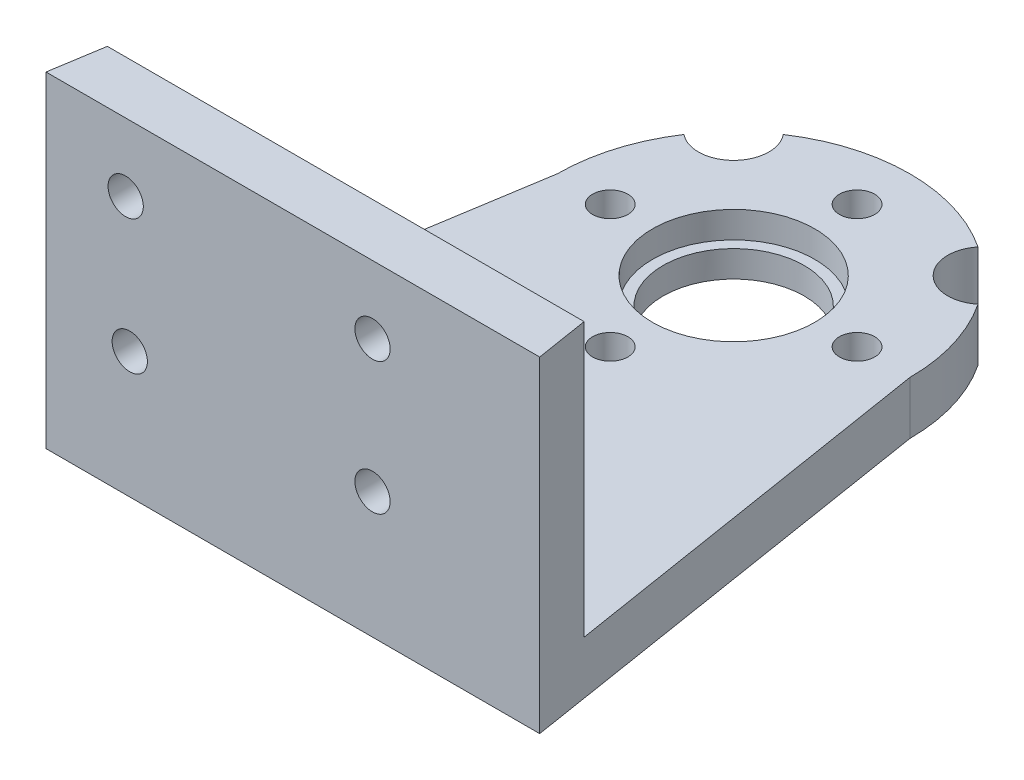
ISO-10303-21;
HEADER;
FILE_DESCRIPTION(('STEP AP214'),'2;1');
FILE_NAME('part.step','',(''),(''),'','','');
FILE_SCHEMA(('AUTOMOTIVE_DESIGN { 1 0 10303 214 1 1 1 1 }'));
ENDSEC;
DATA;
#1=APPLICATION_CONTEXT('core data for automotive mechanical design processes');
#2=APPLICATION_PROTOCOL_DEFINITION('international standard','automotive_design',2000,#1);
#3=PRODUCT_CONTEXT('',#1,'mechanical');
#4=PRODUCT('Part','Part','',(#3));
#5=PRODUCT_RELATED_PRODUCT_CATEGORY('part','',(#4));
#6=PRODUCT_DEFINITION_FORMATION('','',#4);
#7=PRODUCT_DEFINITION_CONTEXT('part definition',#1,'design');
#8=PRODUCT_DEFINITION('design','',#6,#7);
#9=PRODUCT_DEFINITION_SHAPE('','',#8);
#10=(LENGTH_UNIT() NAMED_UNIT(*) SI_UNIT(.MILLI.,.METRE.));
#11=(NAMED_UNIT(*) PLANE_ANGLE_UNIT() SI_UNIT($,.RADIAN.));
#12=(NAMED_UNIT(*) SI_UNIT($,.STERADIAN.) SOLID_ANGLE_UNIT());
#13=UNCERTAINTY_MEASURE_WITH_UNIT(LENGTH_MEASURE(1.E-05),#10,'distance_accuracy_value','');
#14=(GEOMETRIC_REPRESENTATION_CONTEXT(3) GLOBAL_UNCERTAINTY_ASSIGNED_CONTEXT((#13)) GLOBAL_UNIT_ASSIGNED_CONTEXT((#10,
#11,#12)) REPRESENTATION_CONTEXT('',''));
#15=CARTESIAN_POINT('',(0.,0.,0.));
#16=DIRECTION('',(0.,0.,1.));
#17=DIRECTION('',(1.,0.,0.));
#18=AXIS2_PLACEMENT_3D('',#15,#16,#17);
#19=CARTESIAN_POINT('',(0.,3.,0.));
#20=DIRECTION('',(0.,-1.,0.));
#21=DIRECTION('',(0.,0.,-1.));
#22=AXIS2_PLACEMENT_3D('',#19,#20,#21);
#23=CYLINDRICAL_SURFACE('',#22,10.);
#24=CARTESIAN_POINT('',(0.,0.,0.));
#25=DIRECTION('',(0.,1.,0.));
#26=DIRECTION('',(0.,0.,-1.));
#27=AXIS2_PLACEMENT_3D('',#24,#25,#26);
#28=CIRCLE('',#27,10.);
#29=CARTESIAN_POINT('',(10.,0.,0.));
#30=VERTEX_POINT('',#29);
#31=CARTESIAN_POINT('',(8.33677118357518,0.,-5.52252172768116));
#32=VERTEX_POINT('',#31);
#33=EDGE_CURVE('E221',#30,#32,#28,.T.);
#34=ORIENTED_EDGE('',*,*,#33,.T.);
#35=DIRECTION('',(0.,1.,0.));
#36=VECTOR('',#35,1.);
#37=CARTESIAN_POINT('',(8.33677118357519,-2.,-5.52252172768115));
#38=LINE('',#37,#36);
#39=CARTESIAN_POINT('',(8.33677118357519,3.,-5.52252172768115));
#40=VERTEX_POINT('',#39);
#41=EDGE_CURVE('E51',#32,#40,#38,.T.);
#42=ORIENTED_EDGE('',*,*,#41,.T.);
#43=CARTESIAN_POINT('',(0.,3.,0.));
#44=DIRECTION('',(0.,1.,0.));
#45=DIRECTION('',(0.,0.,-1.));
#46=AXIS2_PLACEMENT_3D('',#43,#44,#45);
#47=CIRCLE('',#46,10.);
#48=CARTESIAN_POINT('',(10.,3.,0.));
#49=VERTEX_POINT('',#48);
#50=EDGE_CURVE('E125',#49,#40,#47,.T.);
#51=ORIENTED_EDGE('',*,*,#50,.F.);
#52=DIRECTION('',(0.,-1.,0.));
#53=VECTOR('',#52,1.);
#54=CARTESIAN_POINT('',(10.,3.,0.));
#55=LINE('',#54,#53);
#56=EDGE_CURVE('E149',#49,#30,#55,.T.);
#57=ORIENTED_EDGE('',*,*,#56,.T.);
#58=EDGE_LOOP('',(#34,#42,#51,#57));
#59=FACE_BOUND('',#58,.T.);
#60=ADVANCED_FACE('F37',(#59),#23,.T.);
#61=CARTESIAN_POINT('',(5.52252172768112,3.,-8.33677118357521));
#62=VERTEX_POINT('',#61);
#63=CARTESIAN_POINT('',(-5.52252172768112,3.,-8.33677118357521));
#64=VERTEX_POINT('',#63);
#65=EDGE_CURVE('E122',#62,#64,#47,.T.);
#66=ORIENTED_EDGE('',*,*,#65,.F.);
#67=DIRECTION('',(0.,1.,0.));
#68=VECTOR('',#67,1.);
#69=CARTESIAN_POINT('',(5.52252172768112,-2.,-8.33677118357521));
#70=LINE('',#69,#68);
#71=CARTESIAN_POINT('',(5.52252172768113,0.,-8.3367711835752));
#72=VERTEX_POINT('',#71);
#73=EDGE_CURVE('E112',#62,#72,#70,.F.);
#74=ORIENTED_EDGE('',*,*,#73,.T.);
#75=CARTESIAN_POINT('',(-5.52252172768113,0.,-8.3367711835752));
#76=VERTEX_POINT('',#75);
#77=EDGE_CURVE('E59',#72,#76,#28,.T.);
#78=ORIENTED_EDGE('',*,*,#77,.T.);
#79=DIRECTION('',(0.,1.,0.));
#80=VECTOR('',#79,1.);
#81=CARTESIAN_POINT('',(-5.52252172768112,-2.,-8.33677118357521));
#82=LINE('',#81,#80);
#83=EDGE_CURVE('E129',#76,#64,#82,.T.);
#84=ORIENTED_EDGE('',*,*,#83,.T.);
#85=EDGE_LOOP('',(#66,#74,#78,#84));
#86=FACE_BOUND('',#85,.T.);
#87=ADVANCED_FACE('F128',(#86),#23,.T.);
#88=CARTESIAN_POINT('',(0.,-10.,0.));
#89=DIRECTION('',(0.,1.,0.));
#90=DIRECTION('',(0.,0.,1.));
#91=AXIS2_PLACEMENT_3D('',#88,#89,#90);
#92=CYLINDRICAL_SURFACE('',#91,4.);
#93=CARTESIAN_POINT('',(0.,0.,0.));
#94=DIRECTION('',(0.,-1.,0.));
#95=DIRECTION('',(0.,0.,-1.));
#96=AXIS2_PLACEMENT_3D('',#93,#94,#95);
#97=CIRCLE('',#96,4.);
#98=CARTESIAN_POINT('',(0.,0.,-4.));
#99=VERTEX_POINT('',#98);
#100=EDGE_CURVE('E217',#99,#99,#97,.T.);
#101=ORIENTED_EDGE('',*,*,#100,.T.);
#102=EDGE_LOOP('',(#101));
#103=FACE_BOUND('',#102,.T.);
#104=CARTESIAN_POINT('',(0.,1.5,0.));
#105=DIRECTION('',(0.,1.,0.));
#106=DIRECTION('',(0.,0.,1.));
#107=AXIS2_PLACEMENT_3D('',#104,#105,#106);
#108=CIRCLE('',#107,4.);
#109=CARTESIAN_POINT('',(0.,1.5,4.));
#110=VERTEX_POINT('',#109);
#111=EDGE_CURVE('E155',#110,#110,#108,.F.);
#112=ORIENTED_EDGE('',*,*,#111,.F.);
#113=EDGE_LOOP('',(#112));
#114=FACE_BOUND('',#113,.T.);
#115=ADVANCED_FACE('F352',(#103,#114),#92,.F.);
#116=CARTESIAN_POINT('',(0.,3.,0.));
#117=DIRECTION('',(0.,-1.,0.));
#118=DIRECTION('',(0.,0.,-1.));
#119=AXIS2_PLACEMENT_3D('',#116,#117,#118);
#120=PLANE('',#119);
#121=CARTESIAN_POINT('',(0.,3.,0.));
#122=DIRECTION('',(0.,1.,0.));
#123=DIRECTION('',(0.,0.,1.));
#124=AXIS2_PLACEMENT_3D('',#121,#122,#123);
#125=CIRCLE('',#124,4.6);
#126=CARTESIAN_POINT('',(0.,3.,4.6));
#127=VERTEX_POINT('',#126);
#128=EDGE_CURVE('E276',#127,#127,#125,.T.);
#129=ORIENTED_EDGE('',*,*,#128,.F.);
#130=EDGE_LOOP('',(#129));
#131=FACE_BOUND('',#130,.T.);
#132=CARTESIAN_POINT('',(-6.52,3.,19.));
#133=DIRECTION('',(0.,1.,0.));
#134=DIRECTION('',(0.,0.,1.));
#135=AXIS2_PLACEMENT_3D('',#132,#133,#134);
#136=CIRCLE('',#135,1.);
#137=CARTESIAN_POINT('',(-6.52,3.,20.));
#138=VERTEX_POINT('',#137);
#139=EDGE_CURVE('E136',#138,#138,#136,.T.);
#140=ORIENTED_EDGE('',*,*,#139,.F.);
#141=EDGE_LOOP('',(#140));
#142=FACE_BOUND('',#141,.T.);
#143=CARTESIAN_POINT('',(6.52,3.,19.));
#144=DIRECTION('',(0.,1.,0.));
#145=DIRECTION('',(0.,0.,-1.));
#146=AXIS2_PLACEMENT_3D('',#143,#144,#145);
#147=CIRCLE('',#146,1.);
#148=CARTESIAN_POINT('',(6.52,3.,18.));
#149=VERTEX_POINT('',#148);
#150=EDGE_CURVE('E190',#149,#149,#147,.T.);
#151=ORIENTED_EDGE('',*,*,#150,.F.);
#152=EDGE_LOOP('',(#151));
#153=FACE_BOUND('',#152,.T.);
#154=CARTESIAN_POINT('',(0.,3.,19.));
#155=DIRECTION('',(0.,1.,0.));
#156=DIRECTION('',(0.,0.,1.));
#157=AXIS2_PLACEMENT_3D('',#154,#155,#156);
#158=CIRCLE('',#157,1.);
#159=CARTESIAN_POINT('',(0.,3.,20.));
#160=VERTEX_POINT('',#159);
#161=EDGE_CURVE('E186',#160,#160,#158,.T.);
#162=ORIENTED_EDGE('',*,*,#161,.F.);
#163=EDGE_LOOP('',(#162));
#164=FACE_BOUND('',#163,.T.);
#165=CARTESIAN_POINT('',(0.,3.,7.));
#166=DIRECTION('',(0.,1.,0.));
#167=DIRECTION('',(0.,0.,1.));
#168=AXIS2_PLACEMENT_3D('',#165,#166,#167);
#169=CIRCLE('',#168,1.);
#170=CARTESIAN_POINT('',(0.,3.,8.));
#171=VERTEX_POINT('',#170);
#172=EDGE_CURVE('E180',#171,#171,#169,.T.);
#173=ORIENTED_EDGE('',*,*,#172,.F.);
#174=EDGE_LOOP('',(#173));
#175=FACE_BOUND('',#174,.T.);
#176=CARTESIAN_POINT('',(-7.,3.,0.));
#177=DIRECTION('',(0.,1.,0.));
#178=DIRECTION('',(0.,0.,1.));
#179=AXIS2_PLACEMENT_3D('',#176,#177,#178);
#180=CIRCLE('',#179,1.);
#181=CARTESIAN_POINT('',(-7.,3.,0.999999999999975));
#182=VERTEX_POINT('',#181);
#183=EDGE_CURVE('E174',#182,#182,#180,.T.);
#184=ORIENTED_EDGE('',*,*,#183,.F.);
#185=EDGE_LOOP('',(#184));
#186=FACE_BOUND('',#185,.T.);
#187=CARTESIAN_POINT('',(0.,3.,-7.));
#188=DIRECTION('',(0.,1.,0.));
#189=DIRECTION('',(0.,0.,1.));
#190=AXIS2_PLACEMENT_3D('',#187,#188,#189);
#191=CIRCLE('',#190,1.);
#192=CARTESIAN_POINT('',(0.,3.,-6.));
#193=VERTEX_POINT('',#192);
#194=EDGE_CURVE('E166',#193,#193,#191,.T.);
#195=ORIENTED_EDGE('',*,*,#194,.F.);
#196=EDGE_LOOP('',(#195));
#197=FACE_BOUND('',#196,.T.);
#198=CARTESIAN_POINT('',(7.,3.,0.));
#199=DIRECTION('',(0.,1.,0.));
#200=DIRECTION('',(0.,0.,1.));
#201=AXIS2_PLACEMENT_3D('',#198,#199,#200);
#202=CIRCLE('',#201,1.);
#203=CARTESIAN_POINT('',(7.,3.,1.00000000000007));
#204=VERTEX_POINT('',#203);
#205=EDGE_CURVE('E167',#204,#204,#202,.T.);
#206=ORIENTED_EDGE('',*,*,#205,.F.);
#207=EDGE_LOOP('',(#206));
#208=FACE_BOUND('',#207,.T.);
#209=ORIENTED_EDGE('',*,*,#50,.T.);
#210=CARTESIAN_POINT('',(7.07106781186546,3.,-7.07106781186549));
#211=DIRECTION('',(0.,1.,0.));
#212=DIRECTION('',(0.,0.,-1.));
#213=AXIS2_PLACEMENT_3D('',#210,#211,#212);
#214=CIRCLE('',#213,2.);
#215=EDGE_CURVE('E115',#62,#40,#214,.T.);
#216=ORIENTED_EDGE('',*,*,#215,.F.);
#217=ORIENTED_EDGE('',*,*,#65,.T.);
#218=CARTESIAN_POINT('',(-7.07106781186546,3.,-7.07106781186549));
#219=DIRECTION('',(0.,1.,0.));
#220=DIRECTION('',(0.,0.,1.));
#221=AXIS2_PLACEMENT_3D('',#218,#219,#220);
#222=CIRCLE('',#221,2.);
#223=CARTESIAN_POINT('',(-8.33677118357519,3.,-5.52252172768115));
#224=VERTEX_POINT('',#223);
#225=EDGE_CURVE('E284',#224,#64,#222,.T.);
#226=ORIENTED_EDGE('',*,*,#225,.F.);
#227=CARTESIAN_POINT('',(-10.,3.,0.));
#228=VERTEX_POINT('',#227);
#229=EDGE_CURVE('E130',#224,#228,#47,.T.);
#230=ORIENTED_EDGE('',*,*,#229,.T.);
#231=DIRECTION('',(-0.157990501106673,0.,0.987440631916705));
#232=VECTOR('',#231,1.);
#233=CARTESIAN_POINT('',(-10.,3.,0.));
#234=LINE('',#233,#232);
#235=CARTESIAN_POINT('',(-13.52,3.,22.));
#236=VERTEX_POINT('',#235);
#237=EDGE_CURVE('E132',#228,#236,#234,.T.);
#238=ORIENTED_EDGE('',*,*,#237,.T.);
#239=DIRECTION('',(-1.,0.,0.));
#240=VECTOR('',#239,1.);
#241=CARTESIAN_POINT('',(-13.52,3.,22.));
#242=LINE('',#241,#240);
#243=CARTESIAN_POINT('',(13.52,3.,22.));
#244=VERTEX_POINT('',#243);
#245=EDGE_CURVE('E150',#244,#236,#242,.T.);
#246=ORIENTED_EDGE('',*,*,#245,.F.);
#247=DIRECTION('',(-0.157990501106673,0.,-0.987440631916705));
#248=VECTOR('',#247,1.);
#249=CARTESIAN_POINT('',(10.,3.,0.));
#250=LINE('',#249,#248);
#251=EDGE_CURVE('E145',#244,#49,#250,.T.);
#252=ORIENTED_EDGE('',*,*,#251,.T.);
#253=EDGE_LOOP('',(#209,#216,#217,#226,#230,#238,#246,#252));
#254=FACE_BOUND('',#253,.T.);
#255=ADVANCED_FACE('F120',(#131,#142,#153,#164,#175,#186,#197,#208,#254),#120,.F.);
#256=ORIENTED_EDGE('',*,*,#229,.F.);
#257=DIRECTION('',(0.,1.,0.));
#258=VECTOR('',#257,1.);
#259=CARTESIAN_POINT('',(-8.33677118357519,-2.,-5.52252172768115));
#260=LINE('',#259,#258);
#261=CARTESIAN_POINT('',(-8.33677118357518,0.,-5.52252172768116));
#262=VERTEX_POINT('',#261);
#263=EDGE_CURVE('E282',#224,#262,#260,.F.);
#264=ORIENTED_EDGE('',*,*,#263,.T.);
#265=CARTESIAN_POINT('',(-10.,0.,0.));
#266=VERTEX_POINT('',#265);
#267=EDGE_CURVE('E219',#262,#266,#28,.T.);
#268=ORIENTED_EDGE('',*,*,#267,.T.);
#269=DIRECTION('',(0.,-1.,0.));
#270=VECTOR('',#269,1.);
#271=CARTESIAN_POINT('',(-10.,3.,0.));
#272=LINE('',#271,#270);
#273=EDGE_CURVE('E224',#228,#266,#272,.T.);
#274=ORIENTED_EDGE('',*,*,#273,.F.);
#275=EDGE_LOOP('',(#256,#264,#268,#274));
#276=FACE_BOUND('',#275,.T.);
#277=ADVANCED_FACE('F39',(#276),#23,.T.);
#278=CARTESIAN_POINT('',(-10.,3.,0.));
#279=DIRECTION('',(0.987440631916705,0.,0.157990501106673));
#280=DIRECTION('',(0.157990501106673,0.,-0.987440631916705));
#281=AXIS2_PLACEMENT_3D('',#278,#279,#280);
#282=PLANE('',#281);
#283=DIRECTION('',(-0.157990501106673,0.,0.987440631916705));
#284=VECTOR('',#283,1.);
#285=CARTESIAN_POINT('',(-10.,0.,0.));
#286=LINE('',#285,#284);
#287=CARTESIAN_POINT('',(-14.,0.,25.));
#288=VERTEX_POINT('',#287);
#289=EDGE_CURVE('E238',#266,#288,#286,.T.);
#290=ORIENTED_EDGE('',*,*,#289,.T.);
#291=DIRECTION('',(0.,-1.,0.));
#292=VECTOR('',#291,1.);
#293=CARTESIAN_POINT('',(-14.,3.,25.));
#294=LINE('',#293,#292);
#295=CARTESIAN_POINT('',(-14.,18.5,25.));
#296=VERTEX_POINT('',#295);
#297=EDGE_CURVE('E227',#296,#288,#294,.T.);
#298=ORIENTED_EDGE('',*,*,#297,.F.);
#299=DIRECTION('',(-0.157990501106673,0.,0.987440631916705));
#300=VECTOR('',#299,1.);
#301=CARTESIAN_POINT('',(-13.52,18.5,22.));
#302=LINE('',#301,#300);
#303=CARTESIAN_POINT('',(-13.52,18.5,22.));
#304=VERTEX_POINT('',#303);
#305=EDGE_CURVE('E154',#304,#296,#302,.T.);
#306=ORIENTED_EDGE('',*,*,#305,.F.);
#307=DIRECTION('',(0.,-1.,0.));
#308=VECTOR('',#307,1.);
#309=CARTESIAN_POINT('',(-13.52,18.5,22.));
#310=LINE('',#309,#308);
#311=EDGE_CURVE('E156',#304,#236,#310,.T.);
#312=ORIENTED_EDGE('',*,*,#311,.T.);
#313=ORIENTED_EDGE('',*,*,#237,.F.);
#314=ORIENTED_EDGE('',*,*,#273,.T.);
#315=EDGE_LOOP('',(#290,#298,#306,#312,#313,#314));
#316=FACE_BOUND('',#315,.T.);
#317=ADVANCED_FACE('F330',(#316),#282,.F.);
#318=CARTESIAN_POINT('',(-14.,3.,25.));
#319=DIRECTION('',(0.,0.,-1.));
#320=DIRECTION('',(-1.,0.,0.));
#321=AXIS2_PLACEMENT_3D('',#318,#319,#320);
#322=PLANE('',#321);
#323=CARTESIAN_POINT('',(-9.24883244461856,7.15183711810536,25.));
#324=DIRECTION('',(0.,0.,-1.));
#325=DIRECTION('',(-1.,0.,0.));
#326=AXIS2_PLACEMENT_3D('',#323,#324,#325);
#327=CIRCLE('',#326,1.00000000002312);
#328=CARTESIAN_POINT('',(-10.2488324446417,7.15183711810536,25.));
#329=VERTEX_POINT('',#328);
#330=EDGE_CURVE('E304',#329,#329,#327,.T.);
#331=ORIENTED_EDGE('',*,*,#330,.T.);
#332=EDGE_LOOP('',(#331));
#333=FACE_BOUND('',#332,.T.);
#334=CARTESIAN_POINT('',(-9.48122486488468,14.6518371181054,25.));
#335=DIRECTION('',(0.,0.,-1.));
#336=DIRECTION('',(-1.,0.,0.));
#337=AXIS2_PLACEMENT_3D('',#334,#335,#336);
#338=CIRCLE('',#337,1.00000000002311);
#339=CARTESIAN_POINT('',(-10.4812248649078,14.6518371181054,25.));
#340=VERTEX_POINT('',#339);
#341=EDGE_CURVE('E298',#340,#340,#338,.T.);
#342=ORIENTED_EDGE('',*,*,#341,.T.);
#343=EDGE_LOOP('',(#342));
#344=FACE_BOUND('',#343,.T.);
#345=CARTESIAN_POINT('',(4.51877513511532,14.6518371181054,25.));
#346=DIRECTION('',(0.,0.,-1.));
#347=DIRECTION('',(-1.,0.,0.));
#348=AXIS2_PLACEMENT_3D('',#345,#346,#347);
#349=CIRCLE('',#348,1.00000000002311);
#350=CARTESIAN_POINT('',(3.51877513509221,14.6518371181054,25.));
#351=VERTEX_POINT('',#350);
#352=EDGE_CURVE('E292',#351,#351,#349,.T.);
#353=ORIENTED_EDGE('',*,*,#352,.T.);
#354=EDGE_LOOP('',(#353));
#355=FACE_BOUND('',#354,.T.);
#356=CARTESIAN_POINT('',(4.51877513511533,7.15183711810538,25.));
#357=DIRECTION('',(0.,0.,-1.));
#358=DIRECTION('',(-1.,0.,0.));
#359=AXIS2_PLACEMENT_3D('',#356,#357,#358);
#360=CIRCLE('',#359,1.00000000002312);
#361=CARTESIAN_POINT('',(3.51877513509221,7.15183711810538,25.));
#362=VERTEX_POINT('',#361);
#363=EDGE_CURVE('E126',#362,#362,#360,.T.);
#364=ORIENTED_EDGE('',*,*,#363,.T.);
#365=EDGE_LOOP('',(#364));
#366=FACE_BOUND('',#365,.T.);
#367=DIRECTION('',(1.,0.,0.));
#368=VECTOR('',#367,1.);
#369=CARTESIAN_POINT('',(-14.,0.,25.));
#370=LINE('',#369,#368);
#371=CARTESIAN_POINT('',(14.,0.,25.));
#372=VERTEX_POINT('',#371);
#373=EDGE_CURVE('E236',#288,#372,#370,.T.);
#374=ORIENTED_EDGE('',*,*,#373,.T.);
#375=DIRECTION('',(0.,-1.,0.));
#376=VECTOR('',#375,1.);
#377=CARTESIAN_POINT('',(14.,3.,25.));
#378=LINE('',#377,#376);
#379=CARTESIAN_POINT('',(14.,18.5,25.));
#380=VERTEX_POINT('',#379);
#381=EDGE_CURVE('E230',#380,#372,#378,.T.);
#382=ORIENTED_EDGE('',*,*,#381,.F.);
#383=DIRECTION('',(1.,0.,0.));
#384=VECTOR('',#383,1.);
#385=CARTESIAN_POINT('',(-14.,18.5,25.));
#386=LINE('',#385,#384);
#387=EDGE_CURVE('E270',#296,#380,#386,.T.);
#388=ORIENTED_EDGE('',*,*,#387,.F.);
#389=ORIENTED_EDGE('',*,*,#297,.T.);
#390=EDGE_LOOP('',(#374,#382,#388,#389));
#391=FACE_BOUND('',#390,.T.);
#392=ADVANCED_FACE('F329',(#333,#344,#355,#366,#391),#322,.F.);
#393=CARTESIAN_POINT('',(10.,3.,0.));
#394=DIRECTION('',(-0.987440631916705,0.,0.157990501106673));
#395=DIRECTION('',(0.157990501106673,0.,0.987440631916705));
#396=AXIS2_PLACEMENT_3D('',#393,#394,#395);
#397=PLANE('',#396);
#398=DIRECTION('',(-0.157990501106673,0.,-0.987440631916705));
#399=VECTOR('',#398,1.);
#400=CARTESIAN_POINT('',(10.,0.,0.));
#401=LINE('',#400,#399);
#402=EDGE_CURVE('E133',#372,#30,#401,.T.);
#403=ORIENTED_EDGE('',*,*,#402,.T.);
#404=ORIENTED_EDGE('',*,*,#56,.F.);
#405=ORIENTED_EDGE('',*,*,#251,.F.);
#406=DIRECTION('',(0.,-1.,0.));
#407=VECTOR('',#406,1.);
#408=CARTESIAN_POINT('',(13.52,18.5,22.));
#409=LINE('',#408,#407);
#410=CARTESIAN_POINT('',(13.52,18.5,22.));
#411=VERTEX_POINT('',#410);
#412=EDGE_CURVE('E170',#411,#244,#409,.T.);
#413=ORIENTED_EDGE('',*,*,#412,.F.);
#414=DIRECTION('',(-0.157990501106673,0.,-0.987440631916705));
#415=VECTOR('',#414,1.);
#416=CARTESIAN_POINT('',(14.,18.5,25.));
#417=LINE('',#416,#415);
#418=EDGE_CURVE('E267',#380,#411,#417,.T.);
#419=ORIENTED_EDGE('',*,*,#418,.F.);
#420=ORIENTED_EDGE('',*,*,#381,.T.);
#421=EDGE_LOOP('',(#403,#404,#405,#413,#419,#420));
#422=FACE_BOUND('',#421,.T.);
#423=ADVANCED_FACE('F206',(#422),#397,.F.);
#424=CARTESIAN_POINT('',(0.,0.,0.));
#425=DIRECTION('',(0.,-1.,0.));
#426=DIRECTION('',(0.,0.,-1.));
#427=AXIS2_PLACEMENT_3D('',#424,#425,#426);
#428=PLANE('',#427);
#429=CARTESIAN_POINT('',(7.07106781186546,0.,-7.07106781186549));
#430=DIRECTION('',(0.,-1.,0.));
#431=DIRECTION('',(0.,0.,-1.));
#432=AXIS2_PLACEMENT_3D('',#429,#430,#431);
#433=CIRCLE('',#432,2.);
#434=EDGE_CURVE('E11',#32,#72,#433,.T.);
#435=ORIENTED_EDGE('',*,*,#434,.F.);
#436=ORIENTED_EDGE('',*,*,#33,.F.);
#437=ORIENTED_EDGE('',*,*,#402,.F.);
#438=ORIENTED_EDGE('',*,*,#373,.F.);
#439=ORIENTED_EDGE('',*,*,#289,.F.);
#440=ORIENTED_EDGE('',*,*,#267,.F.);
#441=CARTESIAN_POINT('',(-7.07106781186546,0.,-7.07106781186549));
#442=DIRECTION('',(0.,-1.,0.));
#443=DIRECTION('',(0.,0.,-1.));
#444=AXIS2_PLACEMENT_3D('',#441,#442,#443);
#445=CIRCLE('',#444,2.);
#446=EDGE_CURVE('E45',#76,#262,#445,.T.);
#447=ORIENTED_EDGE('',*,*,#446,.F.);
#448=ORIENTED_EDGE('',*,*,#77,.F.);
#449=EDGE_LOOP('',(#435,#436,#437,#438,#439,#440,#447,#448));
#450=FACE_BOUND('',#449,.T.);
#451=CARTESIAN_POINT('',(7.,0.,0.));
#452=DIRECTION('',(0.,1.,0.));
#453=DIRECTION('',(0.,0.,1.));
#454=AXIS2_PLACEMENT_3D('',#451,#452,#453);
#455=CIRCLE('',#454,1.);
#456=CARTESIAN_POINT('',(7.,0.,1.00000000000007));
#457=VERTEX_POINT('',#456);
#458=EDGE_CURVE('E163',#457,#457,#455,.T.);
#459=ORIENTED_EDGE('',*,*,#458,.T.);
#460=EDGE_LOOP('',(#459));
#461=FACE_BOUND('',#460,.T.);
#462=CARTESIAN_POINT('',(0.,0.,-7.));
#463=DIRECTION('',(0.,1.,0.));
#464=DIRECTION('',(0.,0.,1.));
#465=AXIS2_PLACEMENT_3D('',#462,#463,#464);
#466=CIRCLE('',#465,1.);
#467=CARTESIAN_POINT('',(0.,0.,-6.));
#468=VERTEX_POINT('',#467);
#469=EDGE_CURVE('E171',#468,#468,#466,.T.);
#470=ORIENTED_EDGE('',*,*,#469,.T.);
#471=EDGE_LOOP('',(#470));
#472=FACE_BOUND('',#471,.T.);
#473=CARTESIAN_POINT('',(-7.,0.,0.));
#474=DIRECTION('',(0.,1.,0.));
#475=DIRECTION('',(0.,0.,1.));
#476=AXIS2_PLACEMENT_3D('',#473,#474,#475);
#477=CIRCLE('',#476,1.);
#478=CARTESIAN_POINT('',(-7.,0.,0.999999999999975));
#479=VERTEX_POINT('',#478);
#480=EDGE_CURVE('E177',#479,#479,#477,.T.);
#481=ORIENTED_EDGE('',*,*,#480,.T.);
#482=EDGE_LOOP('',(#481));
#483=FACE_BOUND('',#482,.T.);
#484=CARTESIAN_POINT('',(0.,0.,7.));
#485=DIRECTION('',(0.,1.,0.));
#486=DIRECTION('',(0.,0.,1.));
#487=AXIS2_PLACEMENT_3D('',#484,#485,#486);
#488=CIRCLE('',#487,1.);
#489=CARTESIAN_POINT('',(0.,0.,8.));
#490=VERTEX_POINT('',#489);
#491=EDGE_CURVE('E183',#490,#490,#488,.T.);
#492=ORIENTED_EDGE('',*,*,#491,.T.);
#493=EDGE_LOOP('',(#492));
#494=FACE_BOUND('',#493,.T.);
#495=CARTESIAN_POINT('',(0.,0.,19.));
#496=DIRECTION('',(0.,-1.,0.));
#497=DIRECTION('',(0.,0.,-1.));
#498=AXIS2_PLACEMENT_3D('',#495,#496,#497);
#499=CIRCLE('',#498,1.);
#500=CARTESIAN_POINT('',(0.,0.,18.));
#501=VERTEX_POINT('',#500);
#502=EDGE_CURVE('E146',#501,#501,#499,.T.);
#503=ORIENTED_EDGE('',*,*,#502,.F.);
#504=EDGE_LOOP('',(#503));
#505=FACE_BOUND('',#504,.T.);
#506=CARTESIAN_POINT('',(6.52,0.,19.));
#507=DIRECTION('',(0.,-1.,0.));
#508=DIRECTION('',(0.,0.,-1.));
#509=AXIS2_PLACEMENT_3D('',#506,#507,#508);
#510=CIRCLE('',#509,1.);
#511=CARTESIAN_POINT('',(6.52,0.,18.));
#512=VERTEX_POINT('',#511);
#513=EDGE_CURVE('E192',#512,#512,#510,.T.);
#514=ORIENTED_EDGE('',*,*,#513,.F.);
#515=EDGE_LOOP('',(#514));
#516=FACE_BOUND('',#515,.T.);
#517=CARTESIAN_POINT('',(-6.52,0.,19.));
#518=DIRECTION('',(0.,-1.,0.));
#519=DIRECTION('',(0.,0.,-1.));
#520=AXIS2_PLACEMENT_3D('',#517,#518,#519);
#521=CIRCLE('',#520,1.);
#522=CARTESIAN_POINT('',(-6.52,0.,18.));
#523=VERTEX_POINT('',#522);
#524=EDGE_CURVE('E214',#523,#523,#521,.T.);
#525=ORIENTED_EDGE('',*,*,#524,.F.);
#526=EDGE_LOOP('',(#525));
#527=FACE_BOUND('',#526,.T.);
#528=ORIENTED_EDGE('',*,*,#100,.F.);
#529=EDGE_LOOP('',(#528));
#530=FACE_BOUND('',#529,.T.);
#531=ADVANCED_FACE('F202',(#450,#461,#472,#483,#494,#505,#516,#527,#530),#428,.T.);
#532=CARTESIAN_POINT('',(-6.52,-10.,19.));
#533=DIRECTION('',(0.,1.,0.));
#534=DIRECTION('',(0.,0.,1.));
#535=AXIS2_PLACEMENT_3D('',#532,#533,#534);
#536=CYLINDRICAL_SURFACE('',#535,1.);
#537=ORIENTED_EDGE('',*,*,#524,.T.);
#538=EDGE_LOOP('',(#537));
#539=FACE_BOUND('',#538,.T.);
#540=ORIENTED_EDGE('',*,*,#139,.T.);
#541=EDGE_LOOP('',(#540));
#542=FACE_BOUND('',#541,.T.);
#543=ADVANCED_FACE('F205',(#539,#542),#536,.F.);
#544=CARTESIAN_POINT('',(6.52,-10.,19.));
#545=DIRECTION('',(0.,1.,0.));
#546=DIRECTION('',(0.,0.,1.));
#547=AXIS2_PLACEMENT_3D('',#544,#545,#546);
#548=CYLINDRICAL_SURFACE('',#547,1.);
#549=ORIENTED_EDGE('',*,*,#513,.T.);
#550=EDGE_LOOP('',(#549));
#551=FACE_BOUND('',#550,.T.);
#552=ORIENTED_EDGE('',*,*,#150,.T.);
#553=EDGE_LOOP('',(#552));
#554=FACE_BOUND('',#553,.T.);
#555=ADVANCED_FACE('F490',(#551,#554),#548,.F.);
#556=CARTESIAN_POINT('',(0.,-10.,19.));
#557=DIRECTION('',(0.,1.,0.));
#558=DIRECTION('',(0.,0.,1.));
#559=AXIS2_PLACEMENT_3D('',#556,#557,#558);
#560=CYLINDRICAL_SURFACE('',#559,1.);
#561=ORIENTED_EDGE('',*,*,#502,.T.);
#562=EDGE_LOOP('',(#561));
#563=FACE_BOUND('',#562,.T.);
#564=ORIENTED_EDGE('',*,*,#161,.T.);
#565=EDGE_LOOP('',(#564));
#566=FACE_BOUND('',#565,.T.);
#567=ADVANCED_FACE('F199',(#563,#566),#560,.F.);
#568=CARTESIAN_POINT('',(0.,0.,7.));
#569=DIRECTION('',(0.,1.,0.));
#570=DIRECTION('',(0.,0.,1.));
#571=AXIS2_PLACEMENT_3D('',#568,#569,#570);
#572=CYLINDRICAL_SURFACE('',#571,1.);
#573=ORIENTED_EDGE('',*,*,#491,.F.);
#574=EDGE_LOOP('',(#573));
#575=FACE_BOUND('',#574,.T.);
#576=ORIENTED_EDGE('',*,*,#172,.T.);
#577=EDGE_LOOP('',(#576));
#578=FACE_BOUND('',#577,.T.);
#579=ADVANCED_FACE('F503',(#575,#578),#572,.F.);
#580=CARTESIAN_POINT('',(-7.,0.,0.));
#581=DIRECTION('',(0.,1.,0.));
#582=DIRECTION('',(0.,0.,1.));
#583=AXIS2_PLACEMENT_3D('',#580,#581,#582);
#584=CYLINDRICAL_SURFACE('',#583,1.);
#585=ORIENTED_EDGE('',*,*,#480,.F.);
#586=EDGE_LOOP('',(#585));
#587=FACE_BOUND('',#586,.T.);
#588=ORIENTED_EDGE('',*,*,#183,.T.);
#589=EDGE_LOOP('',(#588));
#590=FACE_BOUND('',#589,.T.);
#591=ADVANCED_FACE('F510',(#587,#590),#584,.F.);
#592=CARTESIAN_POINT('',(0.,0.,-7.));
#593=DIRECTION('',(0.,1.,0.));
#594=DIRECTION('',(0.,0.,1.));
#595=AXIS2_PLACEMENT_3D('',#592,#593,#594);
#596=CYLINDRICAL_SURFACE('',#595,1.);
#597=ORIENTED_EDGE('',*,*,#469,.F.);
#598=EDGE_LOOP('',(#597));
#599=FACE_BOUND('',#598,.T.);
#600=ORIENTED_EDGE('',*,*,#194,.T.);
#601=EDGE_LOOP('',(#600));
#602=FACE_BOUND('',#601,.T.);
#603=ADVANCED_FACE('F517',(#599,#602),#596,.F.);
#604=CARTESIAN_POINT('',(7.,0.,0.));
#605=DIRECTION('',(0.,1.,0.));
#606=DIRECTION('',(0.,0.,1.));
#607=AXIS2_PLACEMENT_3D('',#604,#605,#606);
#608=CYLINDRICAL_SURFACE('',#607,1.);
#609=ORIENTED_EDGE('',*,*,#458,.F.);
#610=EDGE_LOOP('',(#609));
#611=FACE_BOUND('',#610,.T.);
#612=ORIENTED_EDGE('',*,*,#205,.T.);
#613=EDGE_LOOP('',(#612));
#614=FACE_BOUND('',#613,.T.);
#615=ADVANCED_FACE('F318',(#611,#614),#608,.F.);
#616=CARTESIAN_POINT('',(-13.52,18.5,22.));
#617=DIRECTION('',(0.,0.,1.));
#618=DIRECTION('',(1.,0.,0.));
#619=AXIS2_PLACEMENT_3D('',#616,#617,#618);
#620=PLANE('',#619);
#621=CARTESIAN_POINT('',(-9.24883244461856,7.15183711810536,22.));
#622=DIRECTION('',(0.,0.,-1.));
#623=DIRECTION('',(-1.,0.,0.));
#624=AXIS2_PLACEMENT_3D('',#621,#622,#623);
#625=CIRCLE('',#624,1.00000000002312);
#626=CARTESIAN_POINT('',(-10.2488324446417,7.15183711810536,22.));
#627=VERTEX_POINT('',#626);
#628=EDGE_CURVE('E307',#627,#627,#625,.T.);
#629=ORIENTED_EDGE('',*,*,#628,.F.);
#630=EDGE_LOOP('',(#629));
#631=FACE_BOUND('',#630,.T.);
#632=CARTESIAN_POINT('',(-9.48122486488468,14.6518371181054,22.));
#633=DIRECTION('',(0.,0.,-1.));
#634=DIRECTION('',(-1.,0.,0.));
#635=AXIS2_PLACEMENT_3D('',#632,#633,#634);
#636=CIRCLE('',#635,1.00000000002311);
#637=CARTESIAN_POINT('',(-10.4812248649078,14.6518371181054,22.));
#638=VERTEX_POINT('',#637);
#639=EDGE_CURVE('E301',#638,#638,#636,.T.);
#640=ORIENTED_EDGE('',*,*,#639,.F.);
#641=EDGE_LOOP('',(#640));
#642=FACE_BOUND('',#641,.T.);
#643=CARTESIAN_POINT('',(4.51877513511532,14.6518371181054,22.));
#644=DIRECTION('',(0.,0.,-1.));
#645=DIRECTION('',(-1.,0.,0.));
#646=AXIS2_PLACEMENT_3D('',#643,#644,#645);
#647=CIRCLE('',#646,1.00000000002311);
#648=CARTESIAN_POINT('',(3.51877513509221,14.6518371181054,22.));
#649=VERTEX_POINT('',#648);
#650=EDGE_CURVE('E295',#649,#649,#647,.T.);
#651=ORIENTED_EDGE('',*,*,#650,.F.);
#652=EDGE_LOOP('',(#651));
#653=FACE_BOUND('',#652,.T.);
#654=CARTESIAN_POINT('',(4.51877513511533,7.15183711810538,22.));
#655=DIRECTION('',(0.,0.,-1.));
#656=DIRECTION('',(-1.,0.,0.));
#657=AXIS2_PLACEMENT_3D('',#654,#655,#656);
#658=CIRCLE('',#657,1.00000000002312);
#659=CARTESIAN_POINT('',(3.51877513509221,7.15183711810538,22.));
#660=VERTEX_POINT('',#659);
#661=EDGE_CURVE('E289',#660,#660,#658,.T.);
#662=ORIENTED_EDGE('',*,*,#661,.F.);
#663=EDGE_LOOP('',(#662));
#664=FACE_BOUND('',#663,.T.);
#665=ORIENTED_EDGE('',*,*,#245,.T.);
#666=ORIENTED_EDGE('',*,*,#311,.F.);
#667=DIRECTION('',(-1.,0.,0.));
#668=VECTOR('',#667,1.);
#669=CARTESIAN_POINT('',(-13.52,18.5,22.));
#670=LINE('',#669,#668);
#671=EDGE_CURVE('E161',#411,#304,#670,.T.);
#672=ORIENTED_EDGE('',*,*,#671,.F.);
#673=ORIENTED_EDGE('',*,*,#412,.T.);
#674=EDGE_LOOP('',(#665,#666,#672,#673));
#675=FACE_BOUND('',#674,.T.);
#676=ADVANCED_FACE('F314',(#631,#642,#653,#664,#675),#620,.F.);
#677=CARTESIAN_POINT('',(0.,18.5,0.));
#678=DIRECTION('',(0.,1.,0.));
#679=DIRECTION('',(0.,0.,1.));
#680=AXIS2_PLACEMENT_3D('',#677,#678,#679);
#681=PLANE('',#680);
#682=ORIENTED_EDGE('',*,*,#305,.T.);
#683=ORIENTED_EDGE('',*,*,#387,.T.);
#684=ORIENTED_EDGE('',*,*,#418,.T.);
#685=ORIENTED_EDGE('',*,*,#671,.T.);
#686=EDGE_LOOP('',(#682,#683,#684,#685));
#687=FACE_BOUND('',#686,.T.);
#688=ADVANCED_FACE('F317',(#687),#681,.T.);
#689=CARTESIAN_POINT('',(0.,1.5,0.));
#690=DIRECTION('',(0.,1.,0.));
#691=DIRECTION('',(0.,0.,1.));
#692=AXIS2_PLACEMENT_3D('',#689,#690,#691);
#693=PLANE('',#692);
#694=CARTESIAN_POINT('',(0.,1.5,0.));
#695=DIRECTION('',(0.,1.,0.));
#696=DIRECTION('',(0.,0.,1.));
#697=AXIS2_PLACEMENT_3D('',#694,#695,#696);
#698=CIRCLE('',#697,4.6);
#699=CARTESIAN_POINT('',(0.,1.5,4.6));
#700=VERTEX_POINT('',#699);
#701=EDGE_CURVE('E254',#700,#700,#698,.T.);
#702=ORIENTED_EDGE('',*,*,#701,.T.);
#703=EDGE_LOOP('',(#702));
#704=FACE_BOUND('',#703,.T.);
#705=ORIENTED_EDGE('',*,*,#111,.T.);
#706=EDGE_LOOP('',(#705));
#707=FACE_BOUND('',#706,.T.);
#708=ADVANCED_FACE('F344',(#704,#707),#693,.T.);
#709=CARTESIAN_POINT('',(0.,1.5,0.));
#710=DIRECTION('',(0.,1.,0.));
#711=DIRECTION('',(0.,0.,1.));
#712=AXIS2_PLACEMENT_3D('',#709,#710,#711);
#713=CYLINDRICAL_SURFACE('',#712,4.6);
#714=ORIENTED_EDGE('',*,*,#701,.F.);
#715=EDGE_LOOP('',(#714));
#716=FACE_BOUND('',#715,.T.);
#717=ORIENTED_EDGE('',*,*,#128,.T.);
#718=EDGE_LOOP('',(#717));
#719=FACE_BOUND('',#718,.T.);
#720=ADVANCED_FACE('F336',(#716,#719),#713,.F.);
#721=CARTESIAN_POINT('',(-7.07106781186546,-7.,-7.07106781186549));
#722=DIRECTION('',(0.,1.,0.));
#723=DIRECTION('',(0.,0.,1.));
#724=AXIS2_PLACEMENT_3D('',#721,#722,#723);
#725=CYLINDRICAL_SURFACE('',#724,2.);
#726=ORIENTED_EDGE('',*,*,#446,.T.);
#727=ORIENTED_EDGE('',*,*,#263,.F.);
#728=ORIENTED_EDGE('',*,*,#225,.T.);
#729=ORIENTED_EDGE('',*,*,#83,.F.);
#730=EDGE_LOOP('',(#726,#727,#728,#729));
#731=FACE_BOUND('',#730,.T.);
#732=ADVANCED_FACE('F334',(#731),#725,.F.);
#733=CARTESIAN_POINT('',(7.07106781186546,-7.,-7.07106781186549));
#734=DIRECTION('',(0.,1.,0.));
#735=DIRECTION('',(0.,0.,1.));
#736=AXIS2_PLACEMENT_3D('',#733,#734,#735);
#737=CYLINDRICAL_SURFACE('',#736,2.);
#738=ORIENTED_EDGE('',*,*,#434,.T.);
#739=ORIENTED_EDGE('',*,*,#73,.F.);
#740=ORIENTED_EDGE('',*,*,#215,.T.);
#741=ORIENTED_EDGE('',*,*,#41,.F.);
#742=EDGE_LOOP('',(#738,#739,#740,#741));
#743=FACE_BOUND('',#742,.T.);
#744=ADVANCED_FACE('F114',(#743),#737,.F.);
#745=CARTESIAN_POINT('',(4.51877513511533,7.15183711810538,32.));
#746=DIRECTION('',(0.,0.,-1.));
#747=DIRECTION('',(-1.,0.,0.));
#748=AXIS2_PLACEMENT_3D('',#745,#746,#747);
#749=CYLINDRICAL_SURFACE('',#748,1.00000000002312);
#750=ORIENTED_EDGE('',*,*,#661,.T.);
#751=EDGE_LOOP('',(#750));
#752=FACE_BOUND('',#751,.T.);
#753=ORIENTED_EDGE('',*,*,#363,.F.);
#754=EDGE_LOOP('',(#753));
#755=FACE_BOUND('',#754,.T.);
#756=ADVANCED_FACE('F342',(#752,#755),#749,.F.);
#757=CARTESIAN_POINT('',(4.51877513511532,14.6518371181054,32.));
#758=DIRECTION('',(0.,0.,-1.));
#759=DIRECTION('',(-1.,0.,0.));
#760=AXIS2_PLACEMENT_3D('',#757,#758,#759);
#761=CYLINDRICAL_SURFACE('',#760,1.00000000002311);
#762=ORIENTED_EDGE('',*,*,#650,.T.);
#763=EDGE_LOOP('',(#762));
#764=FACE_BOUND('',#763,.T.);
#765=ORIENTED_EDGE('',*,*,#352,.F.);
#766=EDGE_LOOP('',(#765));
#767=FACE_BOUND('',#766,.T.);
#768=ADVANCED_FACE('F384',(#764,#767),#761,.F.);
#769=CARTESIAN_POINT('',(-9.48122486488468,14.6518371181054,32.));
#770=DIRECTION('',(0.,0.,-1.));
#771=DIRECTION('',(-1.,0.,0.));
#772=AXIS2_PLACEMENT_3D('',#769,#770,#771);
#773=CYLINDRICAL_SURFACE('',#772,1.00000000002311);
#774=ORIENTED_EDGE('',*,*,#639,.T.);
#775=EDGE_LOOP('',(#774));
#776=FACE_BOUND('',#775,.T.);
#777=ORIENTED_EDGE('',*,*,#341,.F.);
#778=EDGE_LOOP('',(#777));
#779=FACE_BOUND('',#778,.T.);
#780=ADVANCED_FACE('F390',(#776,#779),#773,.F.);
#781=CARTESIAN_POINT('',(-9.24883244461856,7.15183711810536,32.));
#782=DIRECTION('',(0.,0.,-1.));
#783=DIRECTION('',(-1.,0.,0.));
#784=AXIS2_PLACEMENT_3D('',#781,#782,#783);
#785=CYLINDRICAL_SURFACE('',#784,1.00000000002312);
#786=ORIENTED_EDGE('',*,*,#628,.T.);
#787=EDGE_LOOP('',(#786));
#788=FACE_BOUND('',#787,.T.);
#789=ORIENTED_EDGE('',*,*,#330,.F.);
#790=EDGE_LOOP('',(#789));
#791=FACE_BOUND('',#790,.T.);
#792=ADVANCED_FACE('F311',(#788,#791),#785,.F.);
#793=CLOSED_SHELL('',(#60,#87,#115,#255,#277,#317,#392,#423,#531,#543,#555,#567,#579,#591,#603,
#615,#676,#688,#708,#720,#732,#744,#756,#768,#780,#792));
#794=MANIFOLD_SOLID_BREP('B2',#793);
#795=ADVANCED_BREP_SHAPE_REPRESENTATION('',(#18,#794),#14);
#796=SHAPE_DEFINITION_REPRESENTATION(#9,#795);
ENDSEC;
END-ISO-10303-21;
